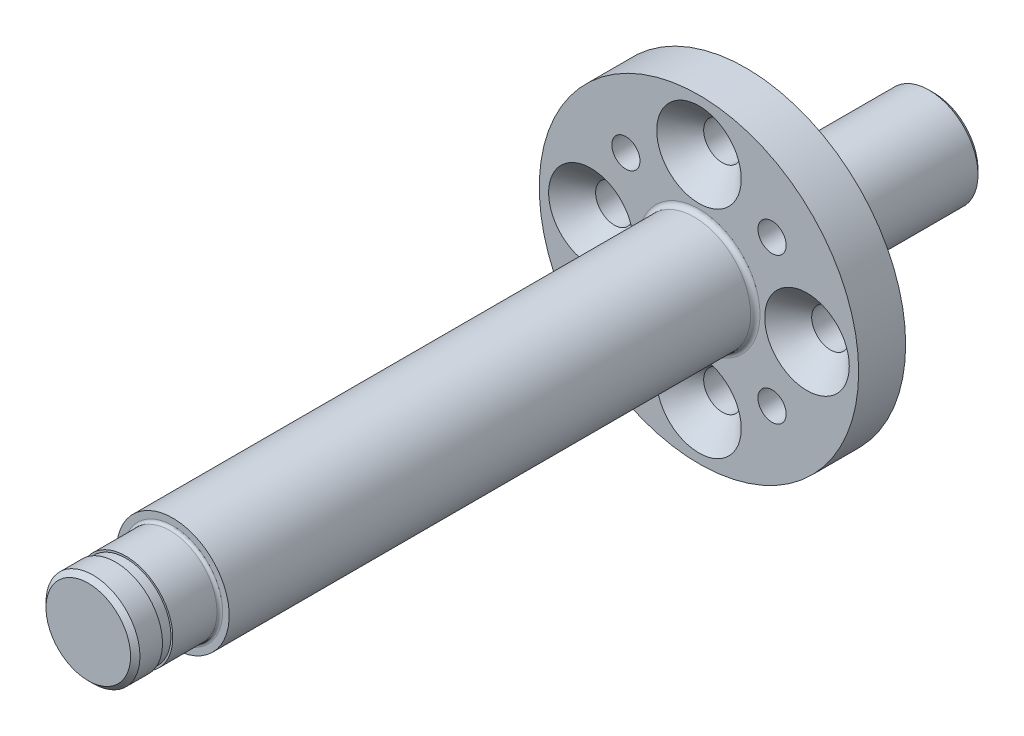
ISO-10303-21;
HEADER;
FILE_DESCRIPTION(('STEP AP214'),'2;1');
FILE_NAME('part.step','',(''),(''),'','','');
FILE_SCHEMA(('AUTOMOTIVE_DESIGN { 1 0 10303 214 1 1 1 1 }'));
ENDSEC;
DATA;
#1=APPLICATION_CONTEXT('core data for automotive mechanical design processes');
#2=APPLICATION_PROTOCOL_DEFINITION('international standard','automotive_design',2000,#1);
#3=PRODUCT_CONTEXT('',#1,'mechanical');
#4=PRODUCT('Part','Part','',(#3));
#5=PRODUCT_RELATED_PRODUCT_CATEGORY('part','',(#4));
#6=PRODUCT_DEFINITION_FORMATION('','',#4);
#7=PRODUCT_DEFINITION_CONTEXT('part definition',#1,'design');
#8=PRODUCT_DEFINITION('design','',#6,#7);
#9=PRODUCT_DEFINITION_SHAPE('','',#8);
#10=(LENGTH_UNIT() NAMED_UNIT(*) SI_UNIT(.MILLI.,.METRE.));
#11=(NAMED_UNIT(*) PLANE_ANGLE_UNIT() SI_UNIT($,.RADIAN.));
#12=(NAMED_UNIT(*) SI_UNIT($,.STERADIAN.) SOLID_ANGLE_UNIT());
#13=UNCERTAINTY_MEASURE_WITH_UNIT(LENGTH_MEASURE(1.E-05),#10,'distance_accuracy_value','');
#14=(GEOMETRIC_REPRESENTATION_CONTEXT(3) GLOBAL_UNCERTAINTY_ASSIGNED_CONTEXT((#13)) GLOBAL_UNIT_ASSIGNED_CONTEXT((#10,
#11,#12)) REPRESENTATION_CONTEXT('',''));
#15=CARTESIAN_POINT('',(0.,0.,0.));
#16=DIRECTION('',(0.,0.,1.));
#17=DIRECTION('',(1.,0.,0.));
#18=AXIS2_PLACEMENT_3D('',#15,#16,#17);
#19=CARTESIAN_POINT('',(0.,0.,5.));
#20=DIRECTION('',(0.,0.,-1.));
#21=DIRECTION('',(-1.,0.,0.));
#22=AXIS2_PLACEMENT_3D('',#19,#20,#21);
#23=CYLINDRICAL_SURFACE('',#22,17.);
#24=CARTESIAN_POINT('',(0.,0.,5.));
#25=DIRECTION('',(0.,0.,1.));
#26=DIRECTION('',(1.,0.,0.));
#27=AXIS2_PLACEMENT_3D('',#24,#25,#26);
#28=CIRCLE('',#27,17.);
#29=CARTESIAN_POINT('',(17.,0.,5.));
#30=VERTEX_POINT('',#29);
#31=EDGE_CURVE('E72',#30,#30,#28,.T.);
#32=ORIENTED_EDGE('',*,*,#31,.F.);
#33=EDGE_LOOP('',(#32));
#34=FACE_BOUND('',#33,.T.);
#35=CARTESIAN_POINT('',(0.,0.,0.));
#36=DIRECTION('',(0.,0.,1.));
#37=DIRECTION('',(1.,0.,0.));
#38=AXIS2_PLACEMENT_3D('',#35,#36,#37);
#39=CIRCLE('',#38,17.);
#40=CARTESIAN_POINT('',(17.,0.,0.));
#41=VERTEX_POINT('',#40);
#42=EDGE_CURVE('E91',#41,#41,#39,.T.);
#43=ORIENTED_EDGE('',*,*,#42,.T.);
#44=EDGE_LOOP('',(#43));
#45=FACE_BOUND('',#44,.T.);
#46=ADVANCED_FACE('F34',(#34,#45),#23,.T.);
#47=CARTESIAN_POINT('',(0.,0.,5.));
#48=DIRECTION('',(0.,0.,1.));
#49=DIRECTION('',(1.,0.,0.));
#50=AXIS2_PLACEMENT_3D('',#47,#48,#49);
#51=PLANE('',#50);
#52=CARTESIAN_POINT('',(0.,0.,5.));
#53=DIRECTION('',(0.,0.,1.));
#54=DIRECTION('',(1.,0.,0.));
#55=AXIS2_PLACEMENT_3D('',#52,#53,#54);
#56=CIRCLE('',#55,6.5);
#57=CARTESIAN_POINT('',(6.5,0.,5.));
#58=VERTEX_POINT('',#57);
#59=EDGE_CURVE('E41',#58,#58,#56,.F.);
#60=ORIENTED_EDGE('',*,*,#59,.T.);
#61=EDGE_LOOP('',(#60));
#62=FACE_BOUND('',#61,.T.);
#63=CARTESIAN_POINT('',(7.77817459305201,7.77817459305204,5.));
#64=DIRECTION('',(0.,0.,1.));
#65=DIRECTION('',(1.,0.,0.));
#66=AXIS2_PLACEMENT_3D('',#63,#64,#65);
#67=CIRCLE('',#66,1.5);
#68=CARTESIAN_POINT('',(9.278174593052,7.77817459305204,5.));
#69=VERTEX_POINT('',#68);
#70=EDGE_CURVE('E135',#69,#69,#67,.T.);
#71=ORIENTED_EDGE('',*,*,#70,.F.);
#72=EDGE_LOOP('',(#71));
#73=FACE_BOUND('',#72,.T.);
#74=CARTESIAN_POINT('',(-7.77817459305201,-7.77817459305203,5.));
#75=DIRECTION('',(0.,0.,1.));
#76=DIRECTION('',(1.,0.,0.));
#77=AXIS2_PLACEMENT_3D('',#74,#75,#76);
#78=CIRCLE('',#77,1.5);
#79=CARTESIAN_POINT('',(-6.27817459305201,-7.77817459305203,5.));
#80=VERTEX_POINT('',#79);
#81=EDGE_CURVE('E129',#80,#80,#78,.T.);
#82=ORIENTED_EDGE('',*,*,#81,.F.);
#83=EDGE_LOOP('',(#82));
#84=FACE_BOUND('',#83,.T.);
#85=CARTESIAN_POINT('',(-7.77817459305204,7.77817459305201,5.));
#86=DIRECTION('',(0.,0.,1.));
#87=DIRECTION('',(1.,0.,0.));
#88=AXIS2_PLACEMENT_3D('',#85,#86,#87);
#89=CIRCLE('',#88,1.5);
#90=CARTESIAN_POINT('',(-6.27817459305204,7.77817459305201,5.));
#91=VERTEX_POINT('',#90);
#92=EDGE_CURVE('E123',#91,#91,#89,.T.);
#93=ORIENTED_EDGE('',*,*,#92,.F.);
#94=EDGE_LOOP('',(#93));
#95=FACE_BOUND('',#94,.T.);
#96=CARTESIAN_POINT('',(7.77817459305204,-7.77817459305201,5.));
#97=DIRECTION('',(0.,0.,1.));
#98=DIRECTION('',(1.,0.,0.));
#99=AXIS2_PLACEMENT_3D('',#96,#97,#98);
#100=CIRCLE('',#99,1.5);
#101=CARTESIAN_POINT('',(9.27817459305203,-7.77817459305201,5.));
#102=VERTEX_POINT('',#101);
#103=EDGE_CURVE('E117',#102,#102,#100,.T.);
#104=ORIENTED_EDGE('',*,*,#103,.F.);
#105=EDGE_LOOP('',(#104));
#106=FACE_BOUND('',#105,.T.);
#107=CARTESIAN_POINT('',(0.,11.5,5.));
#108=DIRECTION('',(0.,0.,1.));
#109=DIRECTION('',(1.,0.,0.));
#110=AXIS2_PLACEMENT_3D('',#107,#108,#109);
#111=CIRCLE('',#110,4.5);
#112=CARTESIAN_POINT('',(4.5,11.5,5.));
#113=VERTEX_POINT('',#112);
#114=EDGE_CURVE('E111',#113,#113,#111,.T.);
#115=ORIENTED_EDGE('',*,*,#114,.F.);
#116=EDGE_LOOP('',(#115));
#117=FACE_BOUND('',#116,.T.);
#118=CARTESIAN_POINT('',(11.5,0.,5.));
#119=DIRECTION('',(0.,0.,1.));
#120=DIRECTION('',(1.,0.,0.));
#121=AXIS2_PLACEMENT_3D('',#118,#119,#120);
#122=CIRCLE('',#121,4.5);
#123=CARTESIAN_POINT('',(16.,0.,5.));
#124=VERTEX_POINT('',#123);
#125=EDGE_CURVE('E76',#124,#124,#122,.T.);
#126=ORIENTED_EDGE('',*,*,#125,.F.);
#127=EDGE_LOOP('',(#126));
#128=FACE_BOUND('',#127,.T.);
#129=CARTESIAN_POINT('',(0.,-11.5,5.));
#130=DIRECTION('',(0.,0.,1.));
#131=DIRECTION('',(1.,0.,0.));
#132=AXIS2_PLACEMENT_3D('',#129,#130,#131);
#133=CIRCLE('',#132,4.5);
#134=CARTESIAN_POINT('',(4.5,-11.5,5.));
#135=VERTEX_POINT('',#134);
#136=EDGE_CURVE('E81',#135,#135,#133,.T.);
#137=ORIENTED_EDGE('',*,*,#136,.F.);
#138=EDGE_LOOP('',(#137));
#139=FACE_BOUND('',#138,.T.);
#140=CARTESIAN_POINT('',(-11.5,0.,5.));
#141=DIRECTION('',(0.,0.,1.));
#142=DIRECTION('',(1.,0.,0.));
#143=AXIS2_PLACEMENT_3D('',#140,#141,#142);
#144=CIRCLE('',#143,4.5);
#145=CARTESIAN_POINT('',(-7.,0.,5.));
#146=VERTEX_POINT('',#145);
#147=EDGE_CURVE('E86',#146,#146,#144,.T.);
#148=ORIENTED_EDGE('',*,*,#147,.F.);
#149=EDGE_LOOP('',(#148));
#150=FACE_BOUND('',#149,.T.);
#151=ORIENTED_EDGE('',*,*,#31,.T.);
#152=EDGE_LOOP('',(#151));
#153=FACE_BOUND('',#152,.T.);
#154=ADVANCED_FACE('F172',(#62,#73,#84,#95,#106,#117,#128,#139,#150,#153),#51,.T.);
#155=CARTESIAN_POINT('',(0.,0.,0.));
#156=DIRECTION('',(0.,0.,1.));
#157=DIRECTION('',(1.,0.,0.));
#158=AXIS2_PLACEMENT_3D('',#155,#156,#157);
#159=PLANE('',#158);
#160=CARTESIAN_POINT('',(0.,0.,0.));
#161=DIRECTION('',(0.,0.,1.));
#162=DIRECTION('',(1.,0.,0.));
#163=AXIS2_PLACEMENT_3D('',#160,#161,#162);
#164=CIRCLE('',#163,5.7);
#165=CARTESIAN_POINT('',(5.7,0.,0.));
#166=VERTEX_POINT('',#165);
#167=EDGE_CURVE('E45',#166,#166,#164,.T.);
#168=ORIENTED_EDGE('',*,*,#167,.T.);
#169=EDGE_LOOP('',(#168));
#170=FACE_BOUND('',#169,.T.);
#171=CARTESIAN_POINT('',(7.77817459305201,7.77817459305204,0.));
#172=DIRECTION('',(0.,0.,1.));
#173=DIRECTION('',(1.,0.,0.));
#174=AXIS2_PLACEMENT_3D('',#171,#172,#173);
#175=CIRCLE('',#174,1.5);
#176=CARTESIAN_POINT('',(9.278174593052,7.77817459305204,0.));
#177=VERTEX_POINT('',#176);
#178=EDGE_CURVE('E132',#177,#177,#175,.T.);
#179=ORIENTED_EDGE('',*,*,#178,.T.);
#180=EDGE_LOOP('',(#179));
#181=FACE_BOUND('',#180,.T.);
#182=CARTESIAN_POINT('',(-7.77817459305201,-7.77817459305203,0.));
#183=DIRECTION('',(0.,0.,1.));
#184=DIRECTION('',(1.,0.,0.));
#185=AXIS2_PLACEMENT_3D('',#182,#183,#184);
#186=CIRCLE('',#185,1.5);
#187=CARTESIAN_POINT('',(-6.27817459305201,-7.77817459305203,0.));
#188=VERTEX_POINT('',#187);
#189=EDGE_CURVE('E126',#188,#188,#186,.T.);
#190=ORIENTED_EDGE('',*,*,#189,.T.);
#191=EDGE_LOOP('',(#190));
#192=FACE_BOUND('',#191,.T.);
#193=CARTESIAN_POINT('',(-7.77817459305204,7.77817459305201,0.));
#194=DIRECTION('',(0.,0.,1.));
#195=DIRECTION('',(1.,0.,0.));
#196=AXIS2_PLACEMENT_3D('',#193,#194,#195);
#197=CIRCLE('',#196,1.5);
#198=CARTESIAN_POINT('',(-6.27817459305204,7.77817459305201,0.));
#199=VERTEX_POINT('',#198);
#200=EDGE_CURVE('E120',#199,#199,#197,.T.);
#201=ORIENTED_EDGE('',*,*,#200,.T.);
#202=EDGE_LOOP('',(#201));
#203=FACE_BOUND('',#202,.T.);
#204=CARTESIAN_POINT('',(7.77817459305204,-7.77817459305201,0.));
#205=DIRECTION('',(0.,0.,1.));
#206=DIRECTION('',(1.,0.,0.));
#207=AXIS2_PLACEMENT_3D('',#204,#205,#206);
#208=CIRCLE('',#207,1.5);
#209=CARTESIAN_POINT('',(9.27817459305203,-7.77817459305201,0.));
#210=VERTEX_POINT('',#209);
#211=EDGE_CURVE('E114',#210,#210,#208,.T.);
#212=ORIENTED_EDGE('',*,*,#211,.T.);
#213=EDGE_LOOP('',(#212));
#214=FACE_BOUND('',#213,.T.);
#215=CARTESIAN_POINT('',(0.,11.5,0.));
#216=DIRECTION('',(0.,0.,1.));
#217=DIRECTION('',(1.,0.,0.));
#218=AXIS2_PLACEMENT_3D('',#215,#216,#217);
#219=CIRCLE('',#218,2.);
#220=CARTESIAN_POINT('',(2.,11.5,0.));
#221=VERTEX_POINT('',#220);
#222=EDGE_CURVE('E73',#221,#221,#219,.T.);
#223=ORIENTED_EDGE('',*,*,#222,.T.);
#224=EDGE_LOOP('',(#223));
#225=FACE_BOUND('',#224,.T.);
#226=CARTESIAN_POINT('',(11.5,0.,0.));
#227=DIRECTION('',(0.,0.,1.));
#228=DIRECTION('',(1.,0.,0.));
#229=AXIS2_PLACEMENT_3D('',#226,#227,#228);
#230=CIRCLE('',#229,2.);
#231=CARTESIAN_POINT('',(13.5,0.,0.));
#232=VERTEX_POINT('',#231);
#233=EDGE_CURVE('E78',#232,#232,#230,.T.);
#234=ORIENTED_EDGE('',*,*,#233,.T.);
#235=EDGE_LOOP('',(#234));
#236=FACE_BOUND('',#235,.T.);
#237=CARTESIAN_POINT('',(0.,-11.5,0.));
#238=DIRECTION('',(0.,0.,1.));
#239=DIRECTION('',(1.,0.,0.));
#240=AXIS2_PLACEMENT_3D('',#237,#238,#239);
#241=CIRCLE('',#240,2.);
#242=CARTESIAN_POINT('',(2.,-11.5,0.));
#243=VERTEX_POINT('',#242);
#244=EDGE_CURVE('E83',#243,#243,#241,.T.);
#245=ORIENTED_EDGE('',*,*,#244,.T.);
#246=EDGE_LOOP('',(#245));
#247=FACE_BOUND('',#246,.T.);
#248=CARTESIAN_POINT('',(-11.5,0.,0.));
#249=DIRECTION('',(0.,0.,1.));
#250=DIRECTION('',(1.,0.,0.));
#251=AXIS2_PLACEMENT_3D('',#248,#249,#250);
#252=CIRCLE('',#251,2.);
#253=CARTESIAN_POINT('',(-9.50000000000001,0.,0.));
#254=VERTEX_POINT('',#253);
#255=EDGE_CURVE('E88',#254,#254,#252,.T.);
#256=ORIENTED_EDGE('',*,*,#255,.T.);
#257=EDGE_LOOP('',(#256));
#258=FACE_BOUND('',#257,.T.);
#259=ORIENTED_EDGE('',*,*,#42,.F.);
#260=EDGE_LOOP('',(#259));
#261=FACE_BOUND('',#260,.T.);
#262=ADVANCED_FACE('F178',(#170,#181,#192,#203,#214,#225,#236,#247,#258,#261),#159,.F.);
#263=CARTESIAN_POINT('',(0.,0.,-20.));
#264=DIRECTION('',(0.,0.,1.));
#265=DIRECTION('',(1.,0.,0.));
#266=AXIS2_PLACEMENT_3D('',#263,#264,#265);
#267=CYLINDRICAL_SURFACE('',#266,5.2);
#268=CARTESIAN_POINT('',(0.,0.,-0.5));
#269=DIRECTION('',(0.,0.,1.));
#270=DIRECTION('',(1.,0.,0.));
#271=AXIS2_PLACEMENT_3D('',#268,#269,#270);
#272=CIRCLE('',#271,5.2);
#273=CARTESIAN_POINT('',(5.2,0.,-0.5));
#274=VERTEX_POINT('',#273);
#275=EDGE_CURVE('E49',#274,#274,#272,.F.);
#276=ORIENTED_EDGE('',*,*,#275,.T.);
#277=EDGE_LOOP('',(#276));
#278=FACE_BOUND('',#277,.T.);
#279=CARTESIAN_POINT('',(0.,0.,-19.5));
#280=DIRECTION('',(0.,0.,-1.));
#281=DIRECTION('',(-1.,0.,0.));
#282=AXIS2_PLACEMENT_3D('',#279,#280,#281);
#283=CIRCLE('',#282,5.2);
#284=CARTESIAN_POINT('',(-5.2,0.,-19.5));
#285=VERTEX_POINT('',#284);
#286=EDGE_CURVE('E66',#285,#285,#283,.F.);
#287=ORIENTED_EDGE('',*,*,#286,.T.);
#288=EDGE_LOOP('',(#287));
#289=FACE_BOUND('',#288,.T.);
#290=ADVANCED_FACE('F205',(#278,#289),#267,.T.);
#291=CARTESIAN_POINT('',(0.,0.,-20.));
#292=DIRECTION('',(0.,0.,-1.));
#293=DIRECTION('',(-1.,0.,0.));
#294=AXIS2_PLACEMENT_3D('',#291,#292,#293);
#295=PLANE('',#294);
#296=CARTESIAN_POINT('',(0.,0.,-20.));
#297=DIRECTION('',(0.,0.,-1.));
#298=DIRECTION('',(-1.,0.,0.));
#299=AXIS2_PLACEMENT_3D('',#296,#297,#298);
#300=CIRCLE('',#299,4.70000000000001);
#301=CARTESIAN_POINT('',(-4.70000000000001,0.,-20.));
#302=VERTEX_POINT('',#301);
#303=EDGE_CURVE('E69',#302,#302,#300,.T.);
#304=ORIENTED_EDGE('',*,*,#303,.T.);
#305=EDGE_LOOP('',(#304));
#306=FACE_BOUND('',#305,.T.);
#307=ADVANCED_FACE('F208',(#306),#295,.T.);
#308=CARTESIAN_POINT('',(-11.5,0.,5.));
#309=DIRECTION('',(0.,0.,1.));
#310=DIRECTION('',(1.,0.,0.));
#311=AXIS2_PLACEMENT_3D('',#308,#309,#310);
#312=CYLINDRICAL_SURFACE('',#311,2.);
#313=CARTESIAN_POINT('',(-11.5,0.,2.5));
#314=DIRECTION('',(0.,0.,1.));
#315=DIRECTION('',(1.,0.,0.));
#316=AXIS2_PLACEMENT_3D('',#313,#314,#315);
#317=CIRCLE('',#316,2.);
#318=CARTESIAN_POINT('',(-9.5,0.,2.5));
#319=VERTEX_POINT('',#318);
#320=EDGE_CURVE('E92',#319,#319,#317,.T.);
#321=ORIENTED_EDGE('',*,*,#320,.T.);
#322=EDGE_LOOP('',(#321));
#323=FACE_BOUND('',#322,.T.);
#324=ORIENTED_EDGE('',*,*,#255,.F.);
#325=EDGE_LOOP('',(#324));
#326=FACE_BOUND('',#325,.T.);
#327=ADVANCED_FACE('F215',(#323,#326),#312,.F.);
#328=CARTESIAN_POINT('',(-11.5,0.,5.));
#329=DIRECTION('',(0.,0.,1.));
#330=DIRECTION('',(1.,0.,0.));
#331=AXIS2_PLACEMENT_3D('',#328,#329,#330);
#332=CONICAL_SURFACE('',#331,4.5,0.785398163397449);
#333=ORIENTED_EDGE('',*,*,#320,.F.);
#334=EDGE_LOOP('',(#333));
#335=FACE_BOUND('',#334,.T.);
#336=ORIENTED_EDGE('',*,*,#147,.T.);
#337=EDGE_LOOP('',(#336));
#338=FACE_BOUND('',#337,.T.);
#339=ADVANCED_FACE('F220',(#335,#338),#332,.F.);
#340=CARTESIAN_POINT('',(0.,-11.5,5.));
#341=DIRECTION('',(0.,0.,1.));
#342=DIRECTION('',(1.,0.,0.));
#343=AXIS2_PLACEMENT_3D('',#340,#341,#342);
#344=CYLINDRICAL_SURFACE('',#343,2.);
#345=CARTESIAN_POINT('',(0.,-11.5,2.5));
#346=DIRECTION('',(0.,0.,1.));
#347=DIRECTION('',(1.,0.,0.));
#348=AXIS2_PLACEMENT_3D('',#345,#346,#347);
#349=CIRCLE('',#348,2.);
#350=CARTESIAN_POINT('',(2.,-11.5,2.5));
#351=VERTEX_POINT('',#350);
#352=EDGE_CURVE('E87',#351,#351,#349,.T.);
#353=ORIENTED_EDGE('',*,*,#352,.T.);
#354=EDGE_LOOP('',(#353));
#355=FACE_BOUND('',#354,.T.);
#356=ORIENTED_EDGE('',*,*,#244,.F.);
#357=EDGE_LOOP('',(#356));
#358=FACE_BOUND('',#357,.T.);
#359=ADVANCED_FACE('F226',(#355,#358),#344,.F.);
#360=CARTESIAN_POINT('',(0.,-11.5,5.));
#361=DIRECTION('',(0.,0.,1.));
#362=DIRECTION('',(1.,0.,0.));
#363=AXIS2_PLACEMENT_3D('',#360,#361,#362);
#364=CONICAL_SURFACE('',#363,4.5,0.785398163397449);
#365=ORIENTED_EDGE('',*,*,#352,.F.);
#366=EDGE_LOOP('',(#365));
#367=FACE_BOUND('',#366,.T.);
#368=ORIENTED_EDGE('',*,*,#136,.T.);
#369=EDGE_LOOP('',(#368));
#370=FACE_BOUND('',#369,.T.);
#371=ADVANCED_FACE('F230',(#367,#370),#364,.F.);
#372=CARTESIAN_POINT('',(11.5,0.,5.));
#373=DIRECTION('',(0.,0.,1.));
#374=DIRECTION('',(1.,0.,0.));
#375=AXIS2_PLACEMENT_3D('',#372,#373,#374);
#376=CYLINDRICAL_SURFACE('',#375,2.);
#377=CARTESIAN_POINT('',(11.5,0.,2.5));
#378=DIRECTION('',(0.,0.,1.));
#379=DIRECTION('',(1.,0.,0.));
#380=AXIS2_PLACEMENT_3D('',#377,#378,#379);
#381=CIRCLE('',#380,2.);
#382=CARTESIAN_POINT('',(13.5,0.,2.5));
#383=VERTEX_POINT('',#382);
#384=EDGE_CURVE('E82',#383,#383,#381,.T.);
#385=ORIENTED_EDGE('',*,*,#384,.T.);
#386=EDGE_LOOP('',(#385));
#387=FACE_BOUND('',#386,.T.);
#388=ORIENTED_EDGE('',*,*,#233,.F.);
#389=EDGE_LOOP('',(#388));
#390=FACE_BOUND('',#389,.T.);
#391=ADVANCED_FACE('F234',(#387,#390),#376,.F.);
#392=CARTESIAN_POINT('',(11.5,0.,5.));
#393=DIRECTION('',(0.,0.,1.));
#394=DIRECTION('',(1.,0.,0.));
#395=AXIS2_PLACEMENT_3D('',#392,#393,#394);
#396=CONICAL_SURFACE('',#395,4.5,0.785398163397449);
#397=ORIENTED_EDGE('',*,*,#384,.F.);
#398=EDGE_LOOP('',(#397));
#399=FACE_BOUND('',#398,.T.);
#400=ORIENTED_EDGE('',*,*,#125,.T.);
#401=EDGE_LOOP('',(#400));
#402=FACE_BOUND('',#401,.T.);
#403=ADVANCED_FACE('F238',(#399,#402),#396,.F.);
#404=CARTESIAN_POINT('',(0.,11.5,5.));
#405=DIRECTION('',(0.,0.,1.));
#406=DIRECTION('',(1.,0.,0.));
#407=AXIS2_PLACEMENT_3D('',#404,#405,#406);
#408=CYLINDRICAL_SURFACE('',#407,2.);
#409=CARTESIAN_POINT('',(0.,11.5,2.5));
#410=DIRECTION('',(0.,0.,1.));
#411=DIRECTION('',(1.,0.,0.));
#412=AXIS2_PLACEMENT_3D('',#409,#410,#411);
#413=CIRCLE('',#412,2.);
#414=CARTESIAN_POINT('',(2.,11.5,2.5));
#415=VERTEX_POINT('',#414);
#416=EDGE_CURVE('E77',#415,#415,#413,.T.);
#417=ORIENTED_EDGE('',*,*,#416,.T.);
#418=EDGE_LOOP('',(#417));
#419=FACE_BOUND('',#418,.T.);
#420=ORIENTED_EDGE('',*,*,#222,.F.);
#421=EDGE_LOOP('',(#420));
#422=FACE_BOUND('',#421,.T.);
#423=ADVANCED_FACE('F242',(#419,#422),#408,.F.);
#424=CARTESIAN_POINT('',(0.,11.5,5.));
#425=DIRECTION('',(0.,0.,1.));
#426=DIRECTION('',(1.,0.,0.));
#427=AXIS2_PLACEMENT_3D('',#424,#425,#426);
#428=CONICAL_SURFACE('',#427,4.5,0.785398163397449);
#429=ORIENTED_EDGE('',*,*,#416,.F.);
#430=EDGE_LOOP('',(#429));
#431=FACE_BOUND('',#430,.T.);
#432=ORIENTED_EDGE('',*,*,#114,.T.);
#433=EDGE_LOOP('',(#432));
#434=FACE_BOUND('',#433,.T.);
#435=ADVANCED_FACE('F246',(#431,#434),#428,.F.);
#436=CARTESIAN_POINT('',(7.77817459305204,-7.77817459305201,5.));
#437=DIRECTION('',(0.,0.,1.));
#438=DIRECTION('',(1.,0.,0.));
#439=AXIS2_PLACEMENT_3D('',#436,#437,#438);
#440=CYLINDRICAL_SURFACE('',#439,1.5);
#441=ORIENTED_EDGE('',*,*,#103,.T.);
#442=EDGE_LOOP('',(#441));
#443=FACE_BOUND('',#442,.T.);
#444=ORIENTED_EDGE('',*,*,#211,.F.);
#445=EDGE_LOOP('',(#444));
#446=FACE_BOUND('',#445,.T.);
#447=ADVANCED_FACE('F250',(#443,#446),#440,.F.);
#448=CARTESIAN_POINT('',(-7.77817459305204,7.77817459305201,5.));
#449=DIRECTION('',(0.,0.,1.));
#450=DIRECTION('',(1.,0.,0.));
#451=AXIS2_PLACEMENT_3D('',#448,#449,#450);
#452=CYLINDRICAL_SURFACE('',#451,1.5);
#453=ORIENTED_EDGE('',*,*,#92,.T.);
#454=EDGE_LOOP('',(#453));
#455=FACE_BOUND('',#454,.T.);
#456=ORIENTED_EDGE('',*,*,#200,.F.);
#457=EDGE_LOOP('',(#456));
#458=FACE_BOUND('',#457,.T.);
#459=ADVANCED_FACE('F254',(#455,#458),#452,.F.);
#460=CARTESIAN_POINT('',(-7.77817459305201,-7.77817459305203,5.));
#461=DIRECTION('',(0.,0.,1.));
#462=DIRECTION('',(1.,0.,0.));
#463=AXIS2_PLACEMENT_3D('',#460,#461,#462);
#464=CYLINDRICAL_SURFACE('',#463,1.5);
#465=ORIENTED_EDGE('',*,*,#81,.T.);
#466=EDGE_LOOP('',(#465));
#467=FACE_BOUND('',#466,.T.);
#468=ORIENTED_EDGE('',*,*,#189,.F.);
#469=EDGE_LOOP('',(#468));
#470=FACE_BOUND('',#469,.T.);
#471=ADVANCED_FACE('F258',(#467,#470),#464,.F.);
#472=CARTESIAN_POINT('',(7.77817459305201,7.77817459305204,5.));
#473=DIRECTION('',(0.,0.,1.));
#474=DIRECTION('',(1.,0.,0.));
#475=AXIS2_PLACEMENT_3D('',#472,#473,#474);
#476=CYLINDRICAL_SURFACE('',#475,1.5);
#477=ORIENTED_EDGE('',*,*,#70,.T.);
#478=EDGE_LOOP('',(#477));
#479=FACE_BOUND('',#478,.T.);
#480=ORIENTED_EDGE('',*,*,#178,.F.);
#481=EDGE_LOOP('',(#480));
#482=FACE_BOUND('',#481,.T.);
#483=ADVANCED_FACE('F262',(#479,#482),#476,.F.);
#484=CARTESIAN_POINT('',(0.,0.,-20.));
#485=DIRECTION('',(0.,0.,-1.));
#486=DIRECTION('',(-1.,0.,0.));
#487=AXIS2_PLACEMENT_3D('',#484,#485,#486);
#488=CYLINDRICAL_SURFACE('',#487,6.);
#489=CARTESIAN_POINT('',(0.,0.,5.5));
#490=DIRECTION('',(0.,0.,1.));
#491=DIRECTION('',(1.,0.,0.));
#492=AXIS2_PLACEMENT_3D('',#489,#490,#491);
#493=CIRCLE('',#492,6.);
#494=CARTESIAN_POINT('',(6.,0.,5.5));
#495=VERTEX_POINT('',#494);
#496=EDGE_CURVE('E10',#495,#495,#493,.T.);
#497=ORIENTED_EDGE('',*,*,#496,.T.);
#498=EDGE_LOOP('',(#497));
#499=FACE_BOUND('',#498,.T.);
#500=CARTESIAN_POINT('',(0.,0.,61.));
#501=DIRECTION('',(0.,0.,-1.));
#502=DIRECTION('',(-1.,0.,0.));
#503=AXIS2_PLACEMENT_3D('',#500,#501,#502);
#504=CIRCLE('',#503,5.99999999999999);
#505=CARTESIAN_POINT('',(-5.99999999999999,0.,61.));
#506=VERTEX_POINT('',#505);
#507=EDGE_CURVE('E138',#506,#506,#504,.T.);
#508=ORIENTED_EDGE('',*,*,#507,.T.);
#509=EDGE_LOOP('',(#508));
#510=FACE_BOUND('',#509,.T.);
#511=ADVANCED_FACE('F266',(#499,#510),#488,.T.);
#512=CARTESIAN_POINT('',(0.,5.99999999999999,61.));
#513=DIRECTION('',(0.,0.,1.));
#514=DIRECTION('',(1.,0.,0.));
#515=AXIS2_PLACEMENT_3D('',#512,#513,#514);
#516=PLANE('',#515);
#517=CARTESIAN_POINT('',(0.,0.,61.));
#518=DIRECTION('',(0.,0.,1.));
#519=DIRECTION('',(1.,0.,0.));
#520=AXIS2_PLACEMENT_3D('',#517,#518,#519);
#521=CIRCLE('',#520,5.29999999999999);
#522=CARTESIAN_POINT('',(5.29999999999999,0.,61.));
#523=VERTEX_POINT('',#522);
#524=EDGE_CURVE('E57',#523,#523,#521,.F.);
#525=ORIENTED_EDGE('',*,*,#524,.T.);
#526=EDGE_LOOP('',(#525));
#527=FACE_BOUND('',#526,.T.);
#528=ORIENTED_EDGE('',*,*,#507,.F.);
#529=EDGE_LOOP('',(#528));
#530=FACE_BOUND('',#529,.T.);
#531=ADVANCED_FACE('F270',(#527,#530),#516,.T.);
#532=CARTESIAN_POINT('',(0.,0.,-20.));
#533=DIRECTION('',(0.,0.,-1.));
#534=DIRECTION('',(-1.,0.,0.));
#535=AXIS2_PLACEMENT_3D('',#532,#533,#534);
#536=CYLINDRICAL_SURFACE('',#535,4.99999999999999);
#537=CARTESIAN_POINT('',(0.,0.,61.3));
#538=DIRECTION('',(0.,0.,1.));
#539=DIRECTION('',(1.,0.,0.));
#540=AXIS2_PLACEMENT_3D('',#537,#538,#539);
#541=CIRCLE('',#540,4.99999999999999);
#542=CARTESIAN_POINT('',(4.99999999999999,0.,61.3));
#543=VERTEX_POINT('',#542);
#544=EDGE_CURVE('E54',#543,#543,#541,.T.);
#545=ORIENTED_EDGE('',*,*,#544,.T.);
#546=EDGE_LOOP('',(#545));
#547=FACE_BOUND('',#546,.T.);
#548=CARTESIAN_POINT('',(0.,0.,66.));
#549=DIRECTION('',(0.,0.,-1.));
#550=DIRECTION('',(-1.,0.,0.));
#551=AXIS2_PLACEMENT_3D('',#548,#549,#550);
#552=CIRCLE('',#551,4.99999999999999);
#553=CARTESIAN_POINT('',(-4.99999999999999,0.,66.));
#554=VERTEX_POINT('',#553);
#555=EDGE_CURVE('E141',#554,#554,#552,.T.);
#556=ORIENTED_EDGE('',*,*,#555,.T.);
#557=EDGE_LOOP('',(#556));
#558=FACE_BOUND('',#557,.T.);
#559=ADVANCED_FACE('F273',(#547,#558),#536,.T.);
#560=CARTESIAN_POINT('',(0.,4.99999999999999,66.));
#561=DIRECTION('',(0.,0.,1.));
#562=DIRECTION('',(1.,0.,0.));
#563=AXIS2_PLACEMENT_3D('',#560,#561,#562);
#564=PLANE('',#563);
#565=CARTESIAN_POINT('',(0.,0.,66.));
#566=DIRECTION('',(0.,0.,-1.));
#567=DIRECTION('',(-1.,0.,0.));
#568=AXIS2_PLACEMENT_3D('',#565,#566,#567);
#569=CIRCLE('',#568,4.79999999999999);
#570=CARTESIAN_POINT('',(-4.79999999999999,0.,66.));
#571=VERTEX_POINT('',#570);
#572=EDGE_CURVE('E144',#571,#571,#569,.T.);
#573=ORIENTED_EDGE('',*,*,#572,.T.);
#574=EDGE_LOOP('',(#573));
#575=FACE_BOUND('',#574,.T.);
#576=ORIENTED_EDGE('',*,*,#555,.F.);
#577=EDGE_LOOP('',(#576));
#578=FACE_BOUND('',#577,.T.);
#579=ADVANCED_FACE('F277',(#575,#578),#564,.T.);
#580=CARTESIAN_POINT('',(0.,0.,-20.));
#581=DIRECTION('',(0.,0.,-1.));
#582=DIRECTION('',(-1.,0.,0.));
#583=AXIS2_PLACEMENT_3D('',#580,#581,#582);
#584=CYLINDRICAL_SURFACE('',#583,4.79999999999999);
#585=CARTESIAN_POINT('',(0.,0.,67.1));
#586=DIRECTION('',(0.,0.,-1.));
#587=DIRECTION('',(-1.,0.,0.));
#588=AXIS2_PLACEMENT_3D('',#585,#586,#587);
#589=CIRCLE('',#588,4.79999999999999);
#590=CARTESIAN_POINT('',(-4.79999999999999,0.,67.1));
#591=VERTEX_POINT('',#590);
#592=EDGE_CURVE('E147',#591,#591,#589,.T.);
#593=ORIENTED_EDGE('',*,*,#592,.T.);
#594=EDGE_LOOP('',(#593));
#595=FACE_BOUND('',#594,.T.);
#596=ORIENTED_EDGE('',*,*,#572,.F.);
#597=EDGE_LOOP('',(#596));
#598=FACE_BOUND('',#597,.T.);
#599=ADVANCED_FACE('F169',(#595,#598),#584,.T.);
#600=CARTESIAN_POINT('',(0.,4.79999999999999,67.1));
#601=DIRECTION('',(0.,0.,-1.));
#602=DIRECTION('',(-1.,0.,0.));
#603=AXIS2_PLACEMENT_3D('',#600,#601,#602);
#604=PLANE('',#603);
#605=CARTESIAN_POINT('',(0.,0.,67.1));
#606=DIRECTION('',(0.,0.,-1.));
#607=DIRECTION('',(-1.,0.,0.));
#608=AXIS2_PLACEMENT_3D('',#605,#606,#607);
#609=CIRCLE('',#608,4.99999999999999);
#610=CARTESIAN_POINT('',(-4.99999999999999,0.,67.1));
#611=VERTEX_POINT('',#610);
#612=EDGE_CURVE('E150',#611,#611,#609,.T.);
#613=ORIENTED_EDGE('',*,*,#612,.T.);
#614=EDGE_LOOP('',(#613));
#615=FACE_BOUND('',#614,.T.);
#616=ORIENTED_EDGE('',*,*,#592,.F.);
#617=EDGE_LOOP('',(#616));
#618=FACE_BOUND('',#617,.T.);
#619=ADVANCED_FACE('F154',(#615,#618),#604,.T.);
#620=CARTESIAN_POINT('',(0.,0.,-20.));
#621=DIRECTION('',(0.,0.,-1.));
#622=DIRECTION('',(-1.,0.,0.));
#623=AXIS2_PLACEMENT_3D('',#620,#621,#622);
#624=CYLINDRICAL_SURFACE('',#623,4.99999999999999);
#625=CARTESIAN_POINT('',(0.,0.,69.5));
#626=DIRECTION('',(0.,0.,1.));
#627=DIRECTION('',(1.,0.,0.));
#628=AXIS2_PLACEMENT_3D('',#625,#626,#627);
#629=CIRCLE('',#628,4.99999999999999);
#630=CARTESIAN_POINT('',(4.99999999999999,0.,69.5));
#631=VERTEX_POINT('',#630);
#632=EDGE_CURVE('E63',#631,#631,#629,.F.);
#633=ORIENTED_EDGE('',*,*,#632,.T.);
#634=EDGE_LOOP('',(#633));
#635=FACE_BOUND('',#634,.T.);
#636=ORIENTED_EDGE('',*,*,#612,.F.);
#637=EDGE_LOOP('',(#636));
#638=FACE_BOUND('',#637,.T.);
#639=ADVANCED_FACE('F157',(#635,#638),#624,.T.);
#640=CARTESIAN_POINT('',(0.,4.99999999999999,70.));
#641=DIRECTION('',(0.,0.,1.));
#642=DIRECTION('',(1.,0.,0.));
#643=AXIS2_PLACEMENT_3D('',#640,#641,#642);
#644=PLANE('',#643);
#645=CARTESIAN_POINT('',(0.,0.,70.));
#646=DIRECTION('',(0.,0.,1.));
#647=DIRECTION('',(1.,0.,0.));
#648=AXIS2_PLACEMENT_3D('',#645,#646,#647);
#649=CIRCLE('',#648,4.49999999999998);
#650=CARTESIAN_POINT('',(4.49999999999998,0.,70.));
#651=VERTEX_POINT('',#650);
#652=EDGE_CURVE('E60',#651,#651,#649,.T.);
#653=ORIENTED_EDGE('',*,*,#652,.T.);
#654=EDGE_LOOP('',(#653));
#655=FACE_BOUND('',#654,.T.);
#656=ADVANCED_FACE('F159',(#655),#644,.T.);
#657=CARTESIAN_POINT('',(0.,0.,-20.));
#658=DIRECTION('',(0.,0.,1.));
#659=DIRECTION('',(1.,0.,0.));
#660=AXIS2_PLACEMENT_3D('',#657,#658,#659);
#661=CONICAL_SURFACE('',#660,4.70000000000001,0.785398163397459);
#662=ORIENTED_EDGE('',*,*,#286,.F.);
#663=EDGE_LOOP('',(#662));
#664=FACE_BOUND('',#663,.T.);
#665=ORIENTED_EDGE('',*,*,#303,.F.);
#666=EDGE_LOOP('',(#665));
#667=FACE_BOUND('',#666,.T.);
#668=ADVANCED_FACE('F166',(#664,#667),#661,.T.);
#669=CARTESIAN_POINT('',(0.,0.,69.5));
#670=DIRECTION('',(0.,0.,-1.));
#671=DIRECTION('',(-1.,0.,0.));
#672=AXIS2_PLACEMENT_3D('',#669,#670,#671);
#673=CONICAL_SURFACE('',#672,4.99999999999999,0.78539816339745);
#674=ORIENTED_EDGE('',*,*,#652,.F.);
#675=EDGE_LOOP('',(#674));
#676=FACE_BOUND('',#675,.T.);
#677=ORIENTED_EDGE('',*,*,#632,.F.);
#678=EDGE_LOOP('',(#677));
#679=FACE_BOUND('',#678,.T.);
#680=ADVANCED_FACE('F186',(#676,#679),#673,.T.);
#681=CARTESIAN_POINT('',(0.,0.,61.3));
#682=DIRECTION('',(0.,0.,1.));
#683=DIRECTION('',(1.,0.,0.));
#684=AXIS2_PLACEMENT_3D('',#681,#682,#683);
#685=TOROIDAL_SURFACE('',#684,5.29999999999999,0.3);
#686=ORIENTED_EDGE('',*,*,#544,.F.);
#687=EDGE_LOOP('',(#686));
#688=FACE_BOUND('',#687,.T.);
#689=ORIENTED_EDGE('',*,*,#524,.F.);
#690=EDGE_LOOP('',(#689));
#691=FACE_BOUND('',#690,.T.);
#692=ADVANCED_FACE('F190',(#688,#691),#685,.F.);
#693=CARTESIAN_POINT('',(0.,0.,-0.5));
#694=DIRECTION('',(0.,0.,1.));
#695=DIRECTION('',(1.,0.,0.));
#696=AXIS2_PLACEMENT_3D('',#693,#694,#695);
#697=TOROIDAL_SURFACE('',#696,5.7,0.5);
#698=ORIENTED_EDGE('',*,*,#167,.F.);
#699=EDGE_LOOP('',(#698));
#700=FACE_BOUND('',#699,.T.);
#701=ORIENTED_EDGE('',*,*,#275,.F.);
#702=EDGE_LOOP('',(#701));
#703=FACE_BOUND('',#702,.T.);
#704=ADVANCED_FACE('F193',(#700,#703),#697,.F.);
#705=CARTESIAN_POINT('',(0.,0.,5.5));
#706=DIRECTION('',(0.,0.,1.));
#707=DIRECTION('',(1.,0.,0.));
#708=AXIS2_PLACEMENT_3D('',#705,#706,#707);
#709=TOROIDAL_SURFACE('',#708,6.5,0.5);
#710=ORIENTED_EDGE('',*,*,#496,.F.);
#711=EDGE_LOOP('',(#710));
#712=FACE_BOUND('',#711,.T.);
#713=ORIENTED_EDGE('',*,*,#59,.F.);
#714=EDGE_LOOP('',(#713));
#715=FACE_BOUND('',#714,.T.);
#716=ADVANCED_FACE('F36',(#712,#715),#709,.F.);
#717=CLOSED_SHELL('',(#46,#154,#262,#290,#307,#327,#339,#359,#371,#391,#403,#423,#435,#447,#459,
#471,#483,#511,#531,#559,#579,#599,#619,#639,#656,#668,#680,#692,#704,#716));
#718=MANIFOLD_SOLID_BREP('B2',#717);
#719=ADVANCED_BREP_SHAPE_REPRESENTATION('',(#18,#718),#14);
#720=SHAPE_DEFINITION_REPRESENTATION(#9,#719);
ENDSEC;
END-ISO-10303-21;
